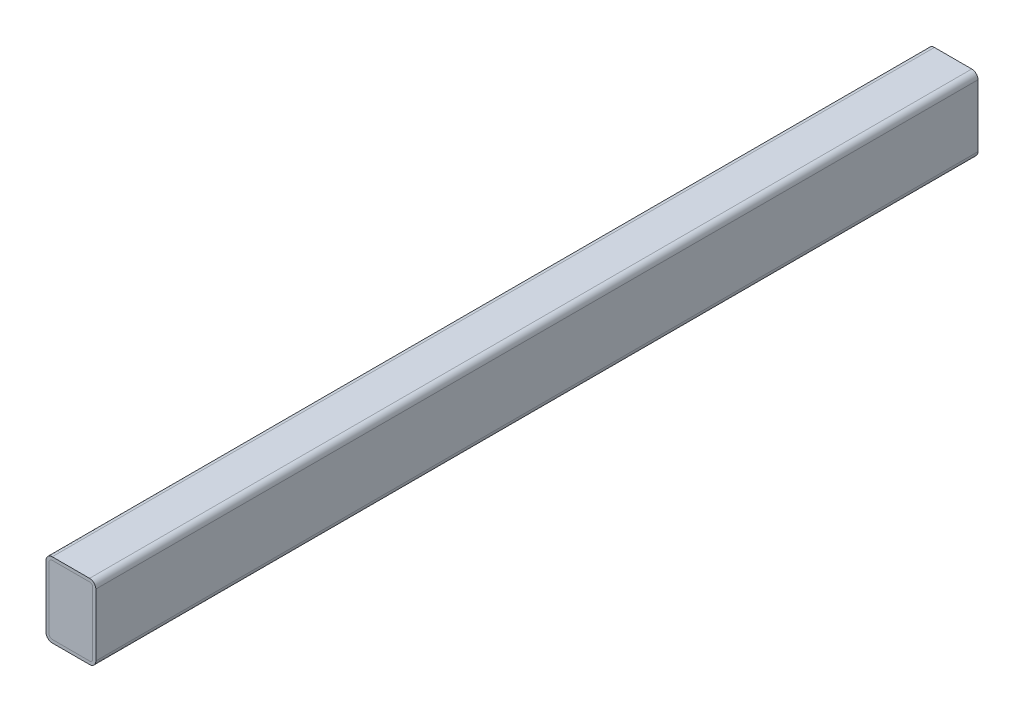
ISO-10303-21;
HEADER;
FILE_DESCRIPTION(('STEP AP214'),'2;1');
FILE_NAME('part.step','',(''),(''),'','','');
FILE_SCHEMA(('AUTOMOTIVE_DESIGN { 1 0 10303 214 1 1 1 1 }'));
ENDSEC;
DATA;
#1=APPLICATION_CONTEXT('core data for automotive mechanical design processes');
#2=APPLICATION_PROTOCOL_DEFINITION('international standard','automotive_design',2000,#1);
#3=PRODUCT_CONTEXT('',#1,'mechanical');
#4=PRODUCT('Part','Part','',(#3));
#5=PRODUCT_RELATED_PRODUCT_CATEGORY('part','',(#4));
#6=PRODUCT_DEFINITION_FORMATION('','',#4);
#7=PRODUCT_DEFINITION_CONTEXT('part definition',#1,'design');
#8=PRODUCT_DEFINITION('design','',#6,#7);
#9=PRODUCT_DEFINITION_SHAPE('','',#8);
#10=(LENGTH_UNIT() NAMED_UNIT(*) SI_UNIT(.MILLI.,.METRE.));
#11=(NAMED_UNIT(*) PLANE_ANGLE_UNIT() SI_UNIT($,.RADIAN.));
#12=(NAMED_UNIT(*) SI_UNIT($,.STERADIAN.) SOLID_ANGLE_UNIT());
#13=UNCERTAINTY_MEASURE_WITH_UNIT(LENGTH_MEASURE(1.E-05),#10,'distance_accuracy_value','');
#14=(GEOMETRIC_REPRESENTATION_CONTEXT(3) GLOBAL_UNCERTAINTY_ASSIGNED_CONTEXT((#13)) GLOBAL_UNIT_ASSIGNED_CONTEXT((#10,
#11,#12)) REPRESENTATION_CONTEXT('',''));
#15=CARTESIAN_POINT('',(0.,0.,0.));
#16=DIRECTION('',(0.,0.,1.));
#17=DIRECTION('',(1.,0.,0.));
#18=AXIS2_PLACEMENT_3D('',#15,#16,#17);
#19=CARTESIAN_POINT('',(-19.05,-31.75,-532.754870546074));
#20=DIRECTION('',(0.,0.,1.));
#21=DIRECTION('',(1.,0.,0.));
#22=AXIS2_PLACEMENT_3D('',#19,#20,#21);
#23=CYLINDRICAL_SURFACE('',#22,3.17500000000001);
#24=CARTESIAN_POINT('',(-19.05,-31.75,-449.961));
#25=DIRECTION('',(0.,0.,1.));
#26=DIRECTION('',(1.,0.,0.));
#27=AXIS2_PLACEMENT_3D('',#24,#25,#26);
#28=CIRCLE('',#27,3.17500000000001);
#29=CARTESIAN_POINT('',(-19.05,-34.925,-449.961));
#30=VERTEX_POINT('',#29);
#31=CARTESIAN_POINT('',(-22.225,-31.75,-449.961));
#32=VERTEX_POINT('',#31);
#33=EDGE_CURVE('E54',#30,#32,#28,.F.);
#34=ORIENTED_EDGE('',*,*,#33,.F.);
#35=DIRECTION('',(0.,0.,1.));
#36=VECTOR('',#35,1.);
#37=CARTESIAN_POINT('',(-19.05,-34.925,-532.754870546074));
#38=LINE('',#37,#36);
#39=CARTESIAN_POINT('',(-19.05,-34.925,449.961));
#40=VERTEX_POINT('',#39);
#41=EDGE_CURVE('E127',#30,#40,#38,.T.);
#42=ORIENTED_EDGE('',*,*,#41,.T.);
#43=CARTESIAN_POINT('',(-19.05,-31.75,449.961));
#44=DIRECTION('',(0.,0.,1.));
#45=DIRECTION('',(1.,0.,0.));
#46=AXIS2_PLACEMENT_3D('',#43,#44,#45);
#47=CIRCLE('',#46,3.17500000000001);
#48=CARTESIAN_POINT('',(-22.225,-31.75,449.961));
#49=VERTEX_POINT('',#48);
#50=EDGE_CURVE('E154',#49,#40,#47,.T.);
#51=ORIENTED_EDGE('',*,*,#50,.F.);
#52=DIRECTION('',(0.,0.,1.));
#53=VECTOR('',#52,1.);
#54=CARTESIAN_POINT('',(-22.225,-31.75,-532.754870546074));
#55=LINE('',#54,#53);
#56=EDGE_CURVE('E114',#32,#49,#55,.T.);
#57=ORIENTED_EDGE('',*,*,#56,.F.);
#58=EDGE_LOOP('',(#34,#42,#51,#57));
#59=FACE_BOUND('',#58,.T.);
#60=ADVANCED_FACE('F47',(#59),#23,.T.);
#61=CARTESIAN_POINT('',(-22.225,31.75,-532.754870546074));
#62=DIRECTION('',(-1.,0.,0.));
#63=DIRECTION('',(0.,-1.,0.));
#64=AXIS2_PLACEMENT_3D('',#61,#62,#63);
#65=PLANE('',#64);
#66=DIRECTION('',(0.,1.,0.));
#67=VECTOR('',#66,1.);
#68=CARTESIAN_POINT('',(-22.225,31.75,-449.961));
#69=LINE('',#68,#67);
#70=CARTESIAN_POINT('',(-22.225,31.75,-449.961));
#71=VERTEX_POINT('',#70);
#72=EDGE_CURVE('E91',#32,#71,#69,.T.);
#73=ORIENTED_EDGE('',*,*,#72,.F.);
#74=ORIENTED_EDGE('',*,*,#56,.T.);
#75=DIRECTION('',(0.,-1.,0.));
#76=VECTOR('',#75,1.);
#77=CARTESIAN_POINT('',(-22.225,31.75,449.961));
#78=LINE('',#77,#76);
#79=CARTESIAN_POINT('',(-22.225,31.75,449.961));
#80=VERTEX_POINT('',#79);
#81=EDGE_CURVE('E129',#80,#49,#78,.T.);
#82=ORIENTED_EDGE('',*,*,#81,.F.);
#83=DIRECTION('',(0.,0.,1.));
#84=VECTOR('',#83,1.);
#85=CARTESIAN_POINT('',(-22.225,31.75,-532.754870546074));
#86=LINE('',#85,#84);
#87=EDGE_CURVE('E112',#71,#80,#86,.T.);
#88=ORIENTED_EDGE('',*,*,#87,.F.);
#89=EDGE_LOOP('',(#73,#74,#82,#88));
#90=FACE_BOUND('',#89,.T.);
#91=ADVANCED_FACE('F179',(#90),#65,.T.);
#92=CARTESIAN_POINT('',(-19.05,31.75,-532.754870546074));
#93=DIRECTION('',(0.,0.,1.));
#94=DIRECTION('',(1.,0.,0.));
#95=AXIS2_PLACEMENT_3D('',#92,#93,#94);
#96=CYLINDRICAL_SURFACE('',#95,3.175);
#97=CARTESIAN_POINT('',(-19.05,31.75,-449.961));
#98=DIRECTION('',(0.,0.,1.));
#99=DIRECTION('',(1.,0.,0.));
#100=AXIS2_PLACEMENT_3D('',#97,#98,#99);
#101=CIRCLE('',#100,3.175);
#102=CARTESIAN_POINT('',(-19.05,34.925,-449.961));
#103=VERTEX_POINT('',#102);
#104=EDGE_CURVE('E87',#71,#103,#101,.F.);
#105=ORIENTED_EDGE('',*,*,#104,.F.);
#106=ORIENTED_EDGE('',*,*,#87,.T.);
#107=CARTESIAN_POINT('',(-19.05,31.75,449.961));
#108=DIRECTION('',(0.,0.,1.));
#109=DIRECTION('',(1.,0.,0.));
#110=AXIS2_PLACEMENT_3D('',#107,#108,#109);
#111=CIRCLE('',#110,3.175);
#112=CARTESIAN_POINT('',(-19.05,34.925,449.961));
#113=VERTEX_POINT('',#112);
#114=EDGE_CURVE('E110',#113,#80,#111,.T.);
#115=ORIENTED_EDGE('',*,*,#114,.F.);
#116=DIRECTION('',(0.,0.,1.));
#117=VECTOR('',#116,1.);
#118=CARTESIAN_POINT('',(-19.05,34.925,-532.754870546074));
#119=LINE('',#118,#117);
#120=EDGE_CURVE('E103',#103,#113,#119,.T.);
#121=ORIENTED_EDGE('',*,*,#120,.F.);
#122=EDGE_LOOP('',(#105,#106,#115,#121));
#123=FACE_BOUND('',#122,.T.);
#124=ADVANCED_FACE('F108',(#123),#96,.T.);
#125=CARTESIAN_POINT('',(19.05,34.925,-532.754870546074));
#126=DIRECTION('',(0.,1.,0.));
#127=DIRECTION('',(0.,0.,1.));
#128=AXIS2_PLACEMENT_3D('',#125,#126,#127);
#129=PLANE('',#128);
#130=DIRECTION('',(1.,0.,0.));
#131=VECTOR('',#130,1.);
#132=CARTESIAN_POINT('',(19.05,34.925,-449.961));
#133=LINE('',#132,#131);
#134=CARTESIAN_POINT('',(19.05,34.925,-449.961));
#135=VERTEX_POINT('',#134);
#136=EDGE_CURVE('E90',#103,#135,#133,.T.);
#137=ORIENTED_EDGE('',*,*,#136,.F.);
#138=ORIENTED_EDGE('',*,*,#120,.T.);
#139=DIRECTION('',(-1.,0.,0.));
#140=VECTOR('',#139,1.);
#141=CARTESIAN_POINT('',(19.05,34.925,449.961));
#142=LINE('',#141,#140);
#143=CARTESIAN_POINT('',(19.05,34.925,449.961));
#144=VERTEX_POINT('',#143);
#145=EDGE_CURVE('E140',#144,#113,#142,.T.);
#146=ORIENTED_EDGE('',*,*,#145,.F.);
#147=DIRECTION('',(0.,0.,1.));
#148=VECTOR('',#147,1.);
#149=CARTESIAN_POINT('',(19.05,34.925,-532.754870546074));
#150=LINE('',#149,#148);
#151=EDGE_CURVE('E106',#135,#144,#150,.T.);
#152=ORIENTED_EDGE('',*,*,#151,.F.);
#153=EDGE_LOOP('',(#137,#138,#146,#152));
#154=FACE_BOUND('',#153,.T.);
#155=ADVANCED_FACE('F100',(#154),#129,.T.);
#156=CARTESIAN_POINT('',(19.05,31.75,-532.754870546074));
#157=DIRECTION('',(0.,0.,1.));
#158=DIRECTION('',(1.,0.,0.));
#159=AXIS2_PLACEMENT_3D('',#156,#157,#158);
#160=CYLINDRICAL_SURFACE('',#159,3.175);
#161=CARTESIAN_POINT('',(19.05,31.75,-449.961));
#162=DIRECTION('',(0.,0.,1.));
#163=DIRECTION('',(1.,0.,0.));
#164=AXIS2_PLACEMENT_3D('',#161,#162,#163);
#165=CIRCLE('',#164,3.175);
#166=CARTESIAN_POINT('',(22.225,31.75,-449.961));
#167=VERTEX_POINT('',#166);
#168=EDGE_CURVE('E67',#135,#167,#165,.F.);
#169=ORIENTED_EDGE('',*,*,#168,.F.);
#170=ORIENTED_EDGE('',*,*,#151,.T.);
#171=CARTESIAN_POINT('',(19.05,31.75,449.961));
#172=DIRECTION('',(0.,0.,1.));
#173=DIRECTION('',(1.,0.,0.));
#174=AXIS2_PLACEMENT_3D('',#171,#172,#173);
#175=CIRCLE('',#174,3.175);
#176=CARTESIAN_POINT('',(22.225,31.75,449.961));
#177=VERTEX_POINT('',#176);
#178=EDGE_CURVE('E165',#177,#144,#175,.T.);
#179=ORIENTED_EDGE('',*,*,#178,.F.);
#180=DIRECTION('',(0.,0.,1.));
#181=VECTOR('',#180,1.);
#182=CARTESIAN_POINT('',(22.225,31.75,-532.754870546074));
#183=LINE('',#182,#181);
#184=EDGE_CURVE('E116',#167,#177,#183,.T.);
#185=ORIENTED_EDGE('',*,*,#184,.F.);
#186=EDGE_LOOP('',(#169,#170,#179,#185));
#187=FACE_BOUND('',#186,.T.);
#188=ADVANCED_FACE('F191',(#187),#160,.T.);
#189=CARTESIAN_POINT('',(22.225,-31.75,-532.754870546074));
#190=DIRECTION('',(1.,0.,0.));
#191=DIRECTION('',(0.,1.,0.));
#192=AXIS2_PLACEMENT_3D('',#189,#190,#191);
#193=PLANE('',#192);
#194=DIRECTION('',(0.,-1.,0.));
#195=VECTOR('',#194,1.);
#196=CARTESIAN_POINT('',(22.225,-31.75,-449.961));
#197=LINE('',#196,#195);
#198=CARTESIAN_POINT('',(22.225,-31.75,-449.961));
#199=VERTEX_POINT('',#198);
#200=EDGE_CURVE('E61',#167,#199,#197,.T.);
#201=ORIENTED_EDGE('',*,*,#200,.F.);
#202=ORIENTED_EDGE('',*,*,#184,.T.);
#203=DIRECTION('',(0.,1.,0.));
#204=VECTOR('',#203,1.);
#205=CARTESIAN_POINT('',(22.225,-31.75,449.961));
#206=LINE('',#205,#204);
#207=CARTESIAN_POINT('',(22.225,-31.75,449.961));
#208=VERTEX_POINT('',#207);
#209=EDGE_CURVE('E162',#208,#177,#206,.T.);
#210=ORIENTED_EDGE('',*,*,#209,.F.);
#211=DIRECTION('',(0.,0.,1.));
#212=VECTOR('',#211,1.);
#213=CARTESIAN_POINT('',(22.225,-31.75,-532.754870546074));
#214=LINE('',#213,#212);
#215=EDGE_CURVE('E122',#199,#208,#214,.T.);
#216=ORIENTED_EDGE('',*,*,#215,.F.);
#217=EDGE_LOOP('',(#201,#202,#210,#216));
#218=FACE_BOUND('',#217,.T.);
#219=ADVANCED_FACE('F189',(#218),#193,.T.);
#220=CARTESIAN_POINT('',(19.05,-31.75,-532.754870546074));
#221=DIRECTION('',(0.,0.,1.));
#222=DIRECTION('',(1.,0.,0.));
#223=AXIS2_PLACEMENT_3D('',#220,#221,#222);
#224=CYLINDRICAL_SURFACE('',#223,3.17500000000001);
#225=CARTESIAN_POINT('',(19.05,-31.75,-449.961));
#226=DIRECTION('',(0.,0.,1.));
#227=DIRECTION('',(1.,0.,0.));
#228=AXIS2_PLACEMENT_3D('',#225,#226,#227);
#229=CIRCLE('',#228,3.17500000000001);
#230=CARTESIAN_POINT('',(19.05,-34.925,-449.961));
#231=VERTEX_POINT('',#230);
#232=EDGE_CURVE('E144',#199,#231,#229,.F.);
#233=ORIENTED_EDGE('',*,*,#232,.F.);
#234=ORIENTED_EDGE('',*,*,#215,.T.);
#235=CARTESIAN_POINT('',(19.05,-31.75,449.961));
#236=DIRECTION('',(0.,0.,1.));
#237=DIRECTION('',(1.,0.,0.));
#238=AXIS2_PLACEMENT_3D('',#235,#236,#237);
#239=CIRCLE('',#238,3.17500000000001);
#240=CARTESIAN_POINT('',(19.05,-34.925,449.961));
#241=VERTEX_POINT('',#240);
#242=EDGE_CURVE('E159',#241,#208,#239,.T.);
#243=ORIENTED_EDGE('',*,*,#242,.F.);
#244=DIRECTION('',(0.,0.,1.));
#245=VECTOR('',#244,1.);
#246=CARTESIAN_POINT('',(19.05,-34.925,-532.754870546074));
#247=LINE('',#246,#245);
#248=EDGE_CURVE('E125',#231,#241,#247,.T.);
#249=ORIENTED_EDGE('',*,*,#248,.F.);
#250=EDGE_LOOP('',(#233,#234,#243,#249));
#251=FACE_BOUND('',#250,.T.);
#252=ADVANCED_FACE('F187',(#251),#224,.T.);
#253=CARTESIAN_POINT('',(-19.05,-34.925,-532.754870546074));
#254=DIRECTION('',(0.,-1.,0.));
#255=DIRECTION('',(0.,0.,-1.));
#256=AXIS2_PLACEMENT_3D('',#253,#254,#255);
#257=PLANE('',#256);
#258=DIRECTION('',(-1.,0.,0.));
#259=VECTOR('',#258,1.);
#260=CARTESIAN_POINT('',(-19.05,-34.925,-449.961));
#261=LINE('',#260,#259);
#262=EDGE_CURVE('E12',#231,#30,#261,.T.);
#263=ORIENTED_EDGE('',*,*,#262,.F.);
#264=ORIENTED_EDGE('',*,*,#248,.T.);
#265=DIRECTION('',(1.,0.,0.));
#266=VECTOR('',#265,1.);
#267=CARTESIAN_POINT('',(-19.05,-34.925,449.961));
#268=LINE('',#267,#266);
#269=EDGE_CURVE('E156',#40,#241,#268,.T.);
#270=ORIENTED_EDGE('',*,*,#269,.F.);
#271=ORIENTED_EDGE('',*,*,#41,.F.);
#272=EDGE_LOOP('',(#263,#264,#270,#271));
#273=FACE_BOUND('',#272,.T.);
#274=ADVANCED_FACE('F212',(#273),#257,.T.);
#275=CARTESIAN_POINT('',(-19.05,-31.75,449.961));
#276=DIRECTION('',(0.,0.,1.));
#277=DIRECTION('',(1.,0.,0.));
#278=AXIS2_PLACEMENT_3D('',#275,#276,#277);
#279=PLANE('',#278);
#280=ORIENTED_EDGE('',*,*,#50,.T.);
#281=ORIENTED_EDGE('',*,*,#269,.T.);
#282=ORIENTED_EDGE('',*,*,#242,.T.);
#283=ORIENTED_EDGE('',*,*,#209,.T.);
#284=ORIENTED_EDGE('',*,*,#178,.T.);
#285=ORIENTED_EDGE('',*,*,#145,.T.);
#286=ORIENTED_EDGE('',*,*,#114,.T.);
#287=ORIENTED_EDGE('',*,*,#81,.T.);
#288=EDGE_LOOP('',(#280,#281,#282,#283,#284,#285,#286,#287));
#289=FACE_BOUND('',#288,.T.);
#290=ADVANCED_FACE('F167',(#289),#279,.T.);
#291=CARTESIAN_POINT('',(-19.05,-31.75,-449.961));
#292=DIRECTION('',(0.,0.,1.));
#293=DIRECTION('',(1.,0.,0.));
#294=AXIS2_PLACEMENT_3D('',#291,#292,#293);
#295=PLANE('',#294);
#296=ORIENTED_EDGE('',*,*,#33,.T.);
#297=ORIENTED_EDGE('',*,*,#72,.T.);
#298=ORIENTED_EDGE('',*,*,#104,.T.);
#299=ORIENTED_EDGE('',*,*,#136,.T.);
#300=ORIENTED_EDGE('',*,*,#168,.T.);
#301=ORIENTED_EDGE('',*,*,#200,.T.);
#302=ORIENTED_EDGE('',*,*,#232,.T.);
#303=ORIENTED_EDGE('',*,*,#262,.T.);
#304=EDGE_LOOP('',(#296,#297,#298,#299,#300,#301,#302,#303));
#305=FACE_BOUND('',#304,.T.);
#306=ADVANCED_FACE('F89',(#305),#295,.F.);
#307=CLOSED_SHELL('',(#60,#91,#124,#155,#188,#219,#252,#274,#290,#306));
#308=MANIFOLD_SOLID_BREP('B2',#307);
#309=CARTESIAN_POINT('',(-19.05,-31.75,449.961));
#310=DIRECTION('',(0.,0.,1.));
#311=DIRECTION('',(1.,0.,0.));
#312=AXIS2_PLACEMENT_3D('',#309,#310,#311);
#313=PLANE('',#312);
#314=CARTESIAN_POINT('',(-19.05,-31.75,449.961));
#315=DIRECTION('',(0.,0.,1.));
#316=DIRECTION('',(1.,0.,0.));
#317=AXIS2_PLACEMENT_3D('',#314,#315,#316);
#318=CIRCLE('',#317,6.35000000000001);
#319=CARTESIAN_POINT('',(-25.4,-31.75,449.961));
#320=VERTEX_POINT('',#319);
#321=CARTESIAN_POINT('',(-19.05,-38.1,449.961));
#322=VERTEX_POINT('',#321);
#323=EDGE_CURVE('E453',#320,#322,#318,.T.);
#324=ORIENTED_EDGE('',*,*,#323,.T.);
#325=DIRECTION('',(1.,0.,0.));
#326=VECTOR('',#325,1.);
#327=CARTESIAN_POINT('',(19.05,-38.1,449.961));
#328=LINE('',#327,#326);
#329=CARTESIAN_POINT('',(19.05,-38.1,449.961));
#330=VERTEX_POINT('',#329);
#331=EDGE_CURVE('E456',#322,#330,#328,.T.);
#332=ORIENTED_EDGE('',*,*,#331,.T.);
#333=CARTESIAN_POINT('',(19.05,-31.75,449.961));
#334=DIRECTION('',(0.,0.,1.));
#335=DIRECTION('',(1.,0.,0.));
#336=AXIS2_PLACEMENT_3D('',#333,#334,#335);
#337=CIRCLE('',#336,6.35);
#338=CARTESIAN_POINT('',(25.4,-31.75,449.961));
#339=VERTEX_POINT('',#338);
#340=EDGE_CURVE('E459',#330,#339,#337,.T.);
#341=ORIENTED_EDGE('',*,*,#340,.T.);
#342=DIRECTION('',(0.,1.,0.));
#343=VECTOR('',#342,1.);
#344=CARTESIAN_POINT('',(25.4,31.75,449.961));
#345=LINE('',#344,#343);
#346=CARTESIAN_POINT('',(25.4,31.75,449.961));
#347=VERTEX_POINT('',#346);
#348=EDGE_CURVE('E461',#339,#347,#345,.T.);
#349=ORIENTED_EDGE('',*,*,#348,.T.);
#350=CARTESIAN_POINT('',(19.05,31.75,449.961));
#351=DIRECTION('',(0.,0.,1.));
#352=DIRECTION('',(1.,0.,0.));
#353=AXIS2_PLACEMENT_3D('',#350,#351,#352);
#354=CIRCLE('',#353,6.35);
#355=CARTESIAN_POINT('',(19.05,38.1,449.961));
#356=VERTEX_POINT('',#355);
#357=EDGE_CURVE('E463',#347,#356,#354,.T.);
#358=ORIENTED_EDGE('',*,*,#357,.T.);
#359=DIRECTION('',(-1.,0.,0.));
#360=VECTOR('',#359,1.);
#361=CARTESIAN_POINT('',(-19.05,38.1,449.961));
#362=LINE('',#361,#360);
#363=CARTESIAN_POINT('',(-19.05,38.1,449.961));
#364=VERTEX_POINT('',#363);
#365=EDGE_CURVE('E465',#356,#364,#362,.T.);
#366=ORIENTED_EDGE('',*,*,#365,.T.);
#367=CARTESIAN_POINT('',(-19.05,31.75,449.961));
#368=DIRECTION('',(0.,0.,1.));
#369=DIRECTION('',(1.,0.,0.));
#370=AXIS2_PLACEMENT_3D('',#367,#368,#369);
#371=CIRCLE('',#370,6.35);
#372=CARTESIAN_POINT('',(-25.4,31.75,449.961));
#373=VERTEX_POINT('',#372);
#374=EDGE_CURVE('E467',#364,#373,#371,.T.);
#375=ORIENTED_EDGE('',*,*,#374,.T.);
#376=DIRECTION('',(0.,-1.,0.));
#377=VECTOR('',#376,1.);
#378=CARTESIAN_POINT('',(-25.4,-31.75,449.961));
#379=LINE('',#378,#377);
#380=EDGE_CURVE('E469',#373,#320,#379,.T.);
#381=ORIENTED_EDGE('',*,*,#380,.T.);
#382=EDGE_LOOP('',(#324,#332,#341,#349,#358,#366,#375,#381));
#383=FACE_BOUND('',#382,.T.);
#384=DIRECTION('',(1.,0.,0.));
#385=VECTOR('',#384,1.);
#386=CARTESIAN_POINT('',(19.05,-34.925,449.961));
#387=LINE('',#386,#385);
#388=CARTESIAN_POINT('',(-19.05,-34.925,449.961));
#389=VERTEX_POINT('',#388);
#390=CARTESIAN_POINT('',(19.05,-34.925,449.961));
#391=VERTEX_POINT('',#390);
#392=EDGE_CURVE('E396',#389,#391,#387,.T.);
#393=ORIENTED_EDGE('',*,*,#392,.F.);
#394=CARTESIAN_POINT('',(-19.05,-31.75,449.961));
#395=DIRECTION('',(0.,0.,1.));
#396=DIRECTION('',(1.,0.,0.));
#397=AXIS2_PLACEMENT_3D('',#394,#395,#396);
#398=CIRCLE('',#397,3.17500000000001);
#399=CARTESIAN_POINT('',(-22.225,-31.75,449.961));
#400=VERTEX_POINT('',#399);
#401=EDGE_CURVE('E388',#400,#389,#398,.T.);
#402=ORIENTED_EDGE('',*,*,#401,.F.);
#403=DIRECTION('',(0.,-1.,0.));
#404=VECTOR('',#403,1.);
#405=CARTESIAN_POINT('',(-22.225,-31.75,449.961));
#406=LINE('',#405,#404);
#407=CARTESIAN_POINT('',(-22.225,31.75,449.961));
#408=VERTEX_POINT('',#407);
#409=EDGE_CURVE('E421',#408,#400,#406,.T.);
#410=ORIENTED_EDGE('',*,*,#409,.F.);
#411=CARTESIAN_POINT('',(-19.05,31.75,449.961));
#412=DIRECTION('',(0.,0.,1.));
#413=DIRECTION('',(1.,0.,0.));
#414=AXIS2_PLACEMENT_3D('',#411,#412,#413);
#415=CIRCLE('',#414,3.175);
#416=CARTESIAN_POINT('',(-19.05,34.925,449.961));
#417=VERTEX_POINT('',#416);
#418=EDGE_CURVE('E419',#417,#408,#415,.T.);
#419=ORIENTED_EDGE('',*,*,#418,.F.);
#420=DIRECTION('',(-1.,0.,0.));
#421=VECTOR('',#420,1.);
#422=CARTESIAN_POINT('',(-19.05,34.925,449.961));
#423=LINE('',#422,#421);
#424=CARTESIAN_POINT('',(19.05,34.925,449.961));
#425=VERTEX_POINT('',#424);
#426=EDGE_CURVE('E417',#425,#417,#423,.T.);
#427=ORIENTED_EDGE('',*,*,#426,.F.);
#428=CARTESIAN_POINT('',(19.05,31.75,449.961));
#429=DIRECTION('',(0.,0.,1.));
#430=DIRECTION('',(1.,0.,0.));
#431=AXIS2_PLACEMENT_3D('',#428,#429,#430);
#432=CIRCLE('',#431,3.175);
#433=CARTESIAN_POINT('',(22.225,31.75,449.961));
#434=VERTEX_POINT('',#433);
#435=EDGE_CURVE('E415',#434,#425,#432,.T.);
#436=ORIENTED_EDGE('',*,*,#435,.F.);
#437=DIRECTION('',(0.,1.,0.));
#438=VECTOR('',#437,1.);
#439=CARTESIAN_POINT('',(22.225,31.75,449.961));
#440=LINE('',#439,#438);
#441=CARTESIAN_POINT('',(22.225,-31.75,449.961));
#442=VERTEX_POINT('',#441);
#443=EDGE_CURVE('E411',#442,#434,#440,.T.);
#444=ORIENTED_EDGE('',*,*,#443,.F.);
#445=CARTESIAN_POINT('',(19.05,-31.75,449.961));
#446=DIRECTION('',(0.,0.,1.));
#447=DIRECTION('',(1.,0.,0.));
#448=AXIS2_PLACEMENT_3D('',#445,#446,#447);
#449=CIRCLE('',#448,3.17500000000001);
#450=EDGE_CURVE('E409',#391,#442,#449,.T.);
#451=ORIENTED_EDGE('',*,*,#450,.F.);
#452=EDGE_LOOP('',(#393,#402,#410,#419,#427,#436,#444,#451));
#453=FACE_BOUND('',#452,.T.);
#454=ADVANCED_FACE('F275',(#383,#453),#313,.T.);
#455=CARTESIAN_POINT('',(-19.05,-31.75,-449.961));
#456=DIRECTION('',(0.,0.,1.));
#457=DIRECTION('',(1.,0.,0.));
#458=AXIS2_PLACEMENT_3D('',#455,#456,#457);
#459=PLANE('',#458);
#460=CARTESIAN_POINT('',(-19.05,-31.75,-449.961));
#461=DIRECTION('',(0.,0.,1.));
#462=DIRECTION('',(1.,0.,0.));
#463=AXIS2_PLACEMENT_3D('',#460,#461,#462);
#464=CIRCLE('',#463,6.35000000000001);
#465=CARTESIAN_POINT('',(-25.4,-31.75,-449.961));
#466=VERTEX_POINT('',#465);
#467=CARTESIAN_POINT('',(-19.05,-38.1,-449.961));
#468=VERTEX_POINT('',#467);
#469=EDGE_CURVE('E404',#466,#468,#464,.T.);
#470=ORIENTED_EDGE('',*,*,#469,.F.);
#471=DIRECTION('',(0.,-1.,0.));
#472=VECTOR('',#471,1.);
#473=CARTESIAN_POINT('',(-25.4,-31.75,-449.961));
#474=LINE('',#473,#472);
#475=CARTESIAN_POINT('',(-25.4,31.75,-449.961));
#476=VERTEX_POINT('',#475);
#477=EDGE_CURVE('E457',#476,#466,#474,.T.);
#478=ORIENTED_EDGE('',*,*,#477,.F.);
#479=CARTESIAN_POINT('',(-19.05,31.75,-449.961));
#480=DIRECTION('',(0.,0.,1.));
#481=DIRECTION('',(1.,0.,0.));
#482=AXIS2_PLACEMENT_3D('',#479,#480,#481);
#483=CIRCLE('',#482,6.35);
#484=CARTESIAN_POINT('',(-19.05,38.1,-449.961));
#485=VERTEX_POINT('',#484);
#486=EDGE_CURVE('E484',#485,#476,#483,.T.);
#487=ORIENTED_EDGE('',*,*,#486,.F.);
#488=DIRECTION('',(-1.,0.,0.));
#489=VECTOR('',#488,1.);
#490=CARTESIAN_POINT('',(-19.05,38.1,-449.961));
#491=LINE('',#490,#489);
#492=CARTESIAN_POINT('',(19.05,38.1,-449.961));
#493=VERTEX_POINT('',#492);
#494=EDGE_CURVE('E482',#493,#485,#491,.T.);
#495=ORIENTED_EDGE('',*,*,#494,.F.);
#496=CARTESIAN_POINT('',(19.05,31.75,-449.961));
#497=DIRECTION('',(0.,0.,1.));
#498=DIRECTION('',(1.,0.,0.));
#499=AXIS2_PLACEMENT_3D('',#496,#497,#498);
#500=CIRCLE('',#499,6.35);
#501=CARTESIAN_POINT('',(25.4,31.75,-449.961));
#502=VERTEX_POINT('',#501);
#503=EDGE_CURVE('E480',#502,#493,#500,.T.);
#504=ORIENTED_EDGE('',*,*,#503,.F.);
#505=DIRECTION('',(0.,1.,0.));
#506=VECTOR('',#505,1.);
#507=CARTESIAN_POINT('',(25.4,31.75,-449.961));
#508=LINE('',#507,#506);
#509=CARTESIAN_POINT('',(25.4,-31.75,-449.961));
#510=VERTEX_POINT('',#509);
#511=EDGE_CURVE('E478',#510,#502,#508,.T.);
#512=ORIENTED_EDGE('',*,*,#511,.F.);
#513=CARTESIAN_POINT('',(19.05,-31.75,-449.961));
#514=DIRECTION('',(0.,0.,1.));
#515=DIRECTION('',(1.,0.,0.));
#516=AXIS2_PLACEMENT_3D('',#513,#514,#515);
#517=CIRCLE('',#516,6.35);
#518=CARTESIAN_POINT('',(19.05,-38.1,-449.961));
#519=VERTEX_POINT('',#518);
#520=EDGE_CURVE('E476',#519,#510,#517,.T.);
#521=ORIENTED_EDGE('',*,*,#520,.F.);
#522=DIRECTION('',(1.,0.,0.));
#523=VECTOR('',#522,1.);
#524=CARTESIAN_POINT('',(19.05,-38.1,-449.961));
#525=LINE('',#524,#523);
#526=EDGE_CURVE('E474',#468,#519,#525,.T.);
#527=ORIENTED_EDGE('',*,*,#526,.F.);
#528=EDGE_LOOP('',(#470,#478,#487,#495,#504,#512,#521,#527));
#529=FACE_BOUND('',#528,.T.);
#530=CARTESIAN_POINT('',(-19.05,-31.75,-449.961));
#531=DIRECTION('',(0.,0.,1.));
#532=DIRECTION('',(1.,0.,0.));
#533=AXIS2_PLACEMENT_3D('',#530,#531,#532);
#534=CIRCLE('',#533,3.17500000000001);
#535=CARTESIAN_POINT('',(-22.225,-31.75,-449.961));
#536=VERTEX_POINT('',#535);
#537=CARTESIAN_POINT('',(-19.05,-34.925,-449.961));
#538=VERTEX_POINT('',#537);
#539=EDGE_CURVE('E298',#536,#538,#534,.T.);
#540=ORIENTED_EDGE('',*,*,#539,.T.);
#541=DIRECTION('',(1.,0.,0.));
#542=VECTOR('',#541,1.);
#543=CARTESIAN_POINT('',(19.05,-34.925,-449.961));
#544=LINE('',#543,#542);
#545=CARTESIAN_POINT('',(19.05,-34.925,-449.961));
#546=VERTEX_POINT('',#545);
#547=EDGE_CURVE('E403',#538,#546,#544,.T.);
#548=ORIENTED_EDGE('',*,*,#547,.T.);
#549=CARTESIAN_POINT('',(19.05,-31.75,-449.961));
#550=DIRECTION('',(0.,0.,1.));
#551=DIRECTION('',(1.,0.,0.));
#552=AXIS2_PLACEMENT_3D('',#549,#550,#551);
#553=CIRCLE('',#552,3.17500000000001);
#554=CARTESIAN_POINT('',(22.225,-31.75,-449.961));
#555=VERTEX_POINT('',#554);
#556=EDGE_CURVE('E425',#546,#555,#553,.T.);
#557=ORIENTED_EDGE('',*,*,#556,.T.);
#558=DIRECTION('',(0.,1.,0.));
#559=VECTOR('',#558,1.);
#560=CARTESIAN_POINT('',(22.225,31.75,-449.961));
#561=LINE('',#560,#559);
#562=CARTESIAN_POINT('',(22.225,31.75,-449.961));
#563=VERTEX_POINT('',#562);
#564=EDGE_CURVE('E428',#555,#563,#561,.T.);
#565=ORIENTED_EDGE('',*,*,#564,.T.);
#566=CARTESIAN_POINT('',(19.05,31.75,-449.961));
#567=DIRECTION('',(0.,0.,1.));
#568=DIRECTION('',(1.,0.,0.));
#569=AXIS2_PLACEMENT_3D('',#566,#567,#568);
#570=CIRCLE('',#569,3.175);
#571=CARTESIAN_POINT('',(19.05,34.925,-449.961));
#572=VERTEX_POINT('',#571);
#573=EDGE_CURVE('E431',#563,#572,#570,.T.);
#574=ORIENTED_EDGE('',*,*,#573,.T.);
#575=DIRECTION('',(-1.,0.,0.));
#576=VECTOR('',#575,1.);
#577=CARTESIAN_POINT('',(-19.05,34.925,-449.961));
#578=LINE('',#577,#576);
#579=CARTESIAN_POINT('',(-19.05,34.925,-449.961));
#580=VERTEX_POINT('',#579);
#581=EDGE_CURVE('E434',#572,#580,#578,.T.);
#582=ORIENTED_EDGE('',*,*,#581,.T.);
#583=CARTESIAN_POINT('',(-19.05,31.75,-449.961));
#584=DIRECTION('',(0.,0.,1.));
#585=DIRECTION('',(1.,0.,0.));
#586=AXIS2_PLACEMENT_3D('',#583,#584,#585);
#587=CIRCLE('',#586,3.175);
#588=CARTESIAN_POINT('',(-22.225,31.75,-449.961));
#589=VERTEX_POINT('',#588);
#590=EDGE_CURVE('E437',#580,#589,#587,.T.);
#591=ORIENTED_EDGE('',*,*,#590,.T.);
#592=DIRECTION('',(0.,-1.,0.));
#593=VECTOR('',#592,1.);
#594=CARTESIAN_POINT('',(-22.225,-31.75,-449.961));
#595=LINE('',#594,#593);
#596=EDGE_CURVE('E397',#589,#536,#595,.T.);
#597=ORIENTED_EDGE('',*,*,#596,.T.);
#598=EDGE_LOOP('',(#540,#548,#557,#565,#574,#582,#591,#597));
#599=FACE_BOUND('',#598,.T.);
#600=ADVANCED_FACE('F514',(#529,#599),#459,.F.);
#601=CARTESIAN_POINT('',(-19.05,-31.75,449.961));
#602=DIRECTION('',(0.,0.,-1.));
#603=DIRECTION('',(-1.,0.,0.));
#604=AXIS2_PLACEMENT_3D('',#601,#602,#603);
#605=CYLINDRICAL_SURFACE('',#604,6.35000000000001);
#606=ORIENTED_EDGE('',*,*,#469,.T.);
#607=DIRECTION('',(0.,0.,-1.));
#608=VECTOR('',#607,1.);
#609=CARTESIAN_POINT('',(-19.05,-38.1,449.961));
#610=LINE('',#609,#608);
#611=EDGE_CURVE('E45',#322,#468,#610,.T.);
#612=ORIENTED_EDGE('',*,*,#611,.F.);
#613=ORIENTED_EDGE('',*,*,#323,.F.);
#614=DIRECTION('',(0.,0.,-1.));
#615=VECTOR('',#614,1.);
#616=CARTESIAN_POINT('',(-25.4,-31.75,449.961));
#617=LINE('',#616,#615);
#618=EDGE_CURVE('E471',#320,#466,#617,.T.);
#619=ORIENTED_EDGE('',*,*,#618,.T.);
#620=EDGE_LOOP('',(#606,#612,#613,#619));
#621=FACE_BOUND('',#620,.T.);
#622=ADVANCED_FACE('F277',(#621),#605,.T.);
#623=CARTESIAN_POINT('',(19.05,-38.1,449.961));
#624=DIRECTION('',(0.,1.,0.));
#625=DIRECTION('',(-1.,0.,0.));
#626=AXIS2_PLACEMENT_3D('',#623,#624,#625);
#627=PLANE('',#626);
#628=ORIENTED_EDGE('',*,*,#526,.T.);
#629=DIRECTION('',(0.,0.,-1.));
#630=VECTOR('',#629,1.);
#631=CARTESIAN_POINT('',(19.05,-38.1,449.961));
#632=LINE('',#631,#630);
#633=EDGE_CURVE('E283',#330,#519,#632,.T.);
#634=ORIENTED_EDGE('',*,*,#633,.F.);
#635=ORIENTED_EDGE('',*,*,#331,.F.);
#636=ORIENTED_EDGE('',*,*,#611,.T.);
#637=EDGE_LOOP('',(#628,#634,#635,#636));
#638=FACE_BOUND('',#637,.T.);
#639=ADVANCED_FACE('F531',(#638),#627,.F.);
#640=CARTESIAN_POINT('',(19.05,-31.75,449.961));
#641=DIRECTION('',(0.,0.,-1.));
#642=DIRECTION('',(-1.,0.,0.));
#643=AXIS2_PLACEMENT_3D('',#640,#641,#642);
#644=CYLINDRICAL_SURFACE('',#643,6.35);
#645=ORIENTED_EDGE('',*,*,#520,.T.);
#646=DIRECTION('',(0.,0.,-1.));
#647=VECTOR('',#646,1.);
#648=CARTESIAN_POINT('',(25.4,-31.75,449.961));
#649=LINE('',#648,#647);
#650=EDGE_CURVE('E501',#339,#510,#649,.T.);
#651=ORIENTED_EDGE('',*,*,#650,.F.);
#652=ORIENTED_EDGE('',*,*,#340,.F.);
#653=ORIENTED_EDGE('',*,*,#633,.T.);
#654=EDGE_LOOP('',(#645,#651,#652,#653));
#655=FACE_BOUND('',#654,.T.);
#656=ADVANCED_FACE('F508',(#655),#644,.T.);
#657=CARTESIAN_POINT('',(25.4,31.75,449.961));
#658=DIRECTION('',(-1.,0.,0.));
#659=DIRECTION('',(0.,-1.,0.));
#660=AXIS2_PLACEMENT_3D('',#657,#658,#659);
#661=PLANE('',#660);
#662=ORIENTED_EDGE('',*,*,#511,.T.);
#663=DIRECTION('',(0.,0.,-1.));
#664=VECTOR('',#663,1.);
#665=CARTESIAN_POINT('',(25.4,31.75,449.961));
#666=LINE('',#665,#664);
#667=EDGE_CURVE('E498',#347,#502,#666,.T.);
#668=ORIENTED_EDGE('',*,*,#667,.F.);
#669=ORIENTED_EDGE('',*,*,#348,.F.);
#670=ORIENTED_EDGE('',*,*,#650,.T.);
#671=EDGE_LOOP('',(#662,#668,#669,#670));
#672=FACE_BOUND('',#671,.T.);
#673=ADVANCED_FACE('F520',(#672),#661,.F.);
#674=CARTESIAN_POINT('',(19.05,31.75,449.961));
#675=DIRECTION('',(0.,0.,-1.));
#676=DIRECTION('',(-1.,0.,0.));
#677=AXIS2_PLACEMENT_3D('',#674,#675,#676);
#678=CYLINDRICAL_SURFACE('',#677,6.35);
#679=ORIENTED_EDGE('',*,*,#503,.T.);
#680=DIRECTION('',(0.,0.,-1.));
#681=VECTOR('',#680,1.);
#682=CARTESIAN_POINT('',(19.05,38.1,449.961));
#683=LINE('',#682,#681);
#684=EDGE_CURVE('E495',#356,#493,#683,.T.);
#685=ORIENTED_EDGE('',*,*,#684,.F.);
#686=ORIENTED_EDGE('',*,*,#357,.F.);
#687=ORIENTED_EDGE('',*,*,#667,.T.);
#688=EDGE_LOOP('',(#679,#685,#686,#687));
#689=FACE_BOUND('',#688,.T.);
#690=ADVANCED_FACE('F524',(#689),#678,.T.);
#691=CARTESIAN_POINT('',(-19.05,38.1,449.961));
#692=DIRECTION('',(0.,-1.,0.));
#693=DIRECTION('',(0.,0.,-1.));
#694=AXIS2_PLACEMENT_3D('',#691,#692,#693);
#695=PLANE('',#694);
#696=ORIENTED_EDGE('',*,*,#494,.T.);
#697=DIRECTION('',(0.,0.,-1.));
#698=VECTOR('',#697,1.);
#699=CARTESIAN_POINT('',(-19.05,38.1,449.961));
#700=LINE('',#699,#698);
#701=EDGE_CURVE('E492',#364,#485,#700,.T.);
#702=ORIENTED_EDGE('',*,*,#701,.F.);
#703=ORIENTED_EDGE('',*,*,#365,.F.);
#704=ORIENTED_EDGE('',*,*,#684,.T.);
#705=EDGE_LOOP('',(#696,#702,#703,#704));
#706=FACE_BOUND('',#705,.T.);
#707=ADVANCED_FACE('F544',(#706),#695,.F.);
#708=CARTESIAN_POINT('',(-19.05,31.75,449.961));
#709=DIRECTION('',(0.,0.,-1.));
#710=DIRECTION('',(-1.,0.,0.));
#711=AXIS2_PLACEMENT_3D('',#708,#709,#710);
#712=CYLINDRICAL_SURFACE('',#711,6.35);
#713=ORIENTED_EDGE('',*,*,#486,.T.);
#714=DIRECTION('',(0.,0.,-1.));
#715=VECTOR('',#714,1.);
#716=CARTESIAN_POINT('',(-25.4,31.75,449.961));
#717=LINE('',#716,#715);
#718=EDGE_CURVE('E489',#373,#476,#717,.T.);
#719=ORIENTED_EDGE('',*,*,#718,.F.);
#720=ORIENTED_EDGE('',*,*,#374,.F.);
#721=ORIENTED_EDGE('',*,*,#701,.T.);
#722=EDGE_LOOP('',(#713,#719,#720,#721));
#723=FACE_BOUND('',#722,.T.);
#724=ADVANCED_FACE('F542',(#723),#712,.T.);
#725=CARTESIAN_POINT('',(-25.4,-31.75,449.961));
#726=DIRECTION('',(1.,0.,0.));
#727=DIRECTION('',(0.,1.,0.));
#728=AXIS2_PLACEMENT_3D('',#725,#726,#727);
#729=PLANE('',#728);
#730=ORIENTED_EDGE('',*,*,#477,.T.);
#731=ORIENTED_EDGE('',*,*,#618,.F.);
#732=ORIENTED_EDGE('',*,*,#380,.F.);
#733=ORIENTED_EDGE('',*,*,#718,.T.);
#734=EDGE_LOOP('',(#730,#731,#732,#733));
#735=FACE_BOUND('',#734,.T.);
#736=ADVANCED_FACE('F537',(#735),#729,.F.);
#737=CARTESIAN_POINT('',(-19.05,-31.75,449.961));
#738=DIRECTION('',(0.,0.,-1.));
#739=DIRECTION('',(-1.,0.,0.));
#740=AXIS2_PLACEMENT_3D('',#737,#738,#739);
#741=CYLINDRICAL_SURFACE('',#740,3.17500000000001);
#742=ORIENTED_EDGE('',*,*,#539,.F.);
#743=DIRECTION('',(0.,0.,-1.));
#744=VECTOR('',#743,1.);
#745=CARTESIAN_POINT('',(-22.225,-31.75,449.961));
#746=LINE('',#745,#744);
#747=EDGE_CURVE('E392',#400,#536,#746,.T.);
#748=ORIENTED_EDGE('',*,*,#747,.F.);
#749=ORIENTED_EDGE('',*,*,#401,.T.);
#750=DIRECTION('',(0.,0.,-1.));
#751=VECTOR('',#750,1.);
#752=CARTESIAN_POINT('',(-19.05,-34.925,449.961));
#753=LINE('',#752,#751);
#754=EDGE_CURVE('E391',#389,#538,#753,.T.);
#755=ORIENTED_EDGE('',*,*,#754,.T.);
#756=EDGE_LOOP('',(#742,#748,#749,#755));
#757=FACE_BOUND('',#756,.T.);
#758=ADVANCED_FACE('F390',(#757),#741,.F.);
#759=CARTESIAN_POINT('',(19.05,-34.925,449.961));
#760=DIRECTION('',(0.,1.,0.));
#761=DIRECTION('',(0.,0.,1.));
#762=AXIS2_PLACEMENT_3D('',#759,#760,#761);
#763=PLANE('',#762);
#764=ORIENTED_EDGE('',*,*,#547,.F.);
#765=ORIENTED_EDGE('',*,*,#754,.F.);
#766=ORIENTED_EDGE('',*,*,#392,.T.);
#767=DIRECTION('',(0.,0.,-1.));
#768=VECTOR('',#767,1.);
#769=CARTESIAN_POINT('',(19.05,-34.925,449.961));
#770=LINE('',#769,#768);
#771=EDGE_CURVE('E405',#391,#546,#770,.T.);
#772=ORIENTED_EDGE('',*,*,#771,.T.);
#773=EDGE_LOOP('',(#764,#765,#766,#772));
#774=FACE_BOUND('',#773,.T.);
#775=ADVANCED_FACE('F400',(#774),#763,.T.);
#776=CARTESIAN_POINT('',(19.05,-31.75,449.961));
#777=DIRECTION('',(0.,0.,-1.));
#778=DIRECTION('',(-1.,0.,0.));
#779=AXIS2_PLACEMENT_3D('',#776,#777,#778);
#780=CYLINDRICAL_SURFACE('',#779,3.17500000000001);
#781=ORIENTED_EDGE('',*,*,#556,.F.);
#782=ORIENTED_EDGE('',*,*,#771,.F.);
#783=ORIENTED_EDGE('',*,*,#450,.T.);
#784=DIRECTION('',(0.,0.,-1.));
#785=VECTOR('',#784,1.);
#786=CARTESIAN_POINT('',(22.225,-31.75,449.961));
#787=LINE('',#786,#785);
#788=EDGE_CURVE('E450',#442,#555,#787,.T.);
#789=ORIENTED_EDGE('',*,*,#788,.T.);
#790=EDGE_LOOP('',(#781,#782,#783,#789));
#791=FACE_BOUND('',#790,.T.);
#792=ADVANCED_FACE('F569',(#791),#780,.F.);
#793=CARTESIAN_POINT('',(22.225,31.75,449.961));
#794=DIRECTION('',(-1.,0.,0.));
#795=DIRECTION('',(0.,-1.,0.));
#796=AXIS2_PLACEMENT_3D('',#793,#794,#795);
#797=PLANE('',#796);
#798=ORIENTED_EDGE('',*,*,#564,.F.);
#799=ORIENTED_EDGE('',*,*,#788,.F.);
#800=ORIENTED_EDGE('',*,*,#443,.T.);
#801=DIRECTION('',(0.,0.,-1.));
#802=VECTOR('',#801,1.);
#803=CARTESIAN_POINT('',(22.225,31.75,449.961));
#804=LINE('',#803,#802);
#805=EDGE_CURVE('E448',#434,#563,#804,.T.);
#806=ORIENTED_EDGE('',*,*,#805,.T.);
#807=EDGE_LOOP('',(#798,#799,#800,#806));
#808=FACE_BOUND('',#807,.T.);
#809=ADVANCED_FACE('F573',(#808),#797,.T.);
#810=CARTESIAN_POINT('',(19.05,31.75,449.961));
#811=DIRECTION('',(0.,0.,-1.));
#812=DIRECTION('',(-1.,0.,0.));
#813=AXIS2_PLACEMENT_3D('',#810,#811,#812);
#814=CYLINDRICAL_SURFACE('',#813,3.175);
#815=ORIENTED_EDGE('',*,*,#573,.F.);
#816=ORIENTED_EDGE('',*,*,#805,.F.);
#817=ORIENTED_EDGE('',*,*,#435,.T.);
#818=DIRECTION('',(0.,0.,-1.));
#819=VECTOR('',#818,1.);
#820=CARTESIAN_POINT('',(19.05,34.925,449.961));
#821=LINE('',#820,#819);
#822=EDGE_CURVE('E446',#425,#572,#821,.T.);
#823=ORIENTED_EDGE('',*,*,#822,.T.);
#824=EDGE_LOOP('',(#815,#816,#817,#823));
#825=FACE_BOUND('',#824,.T.);
#826=ADVANCED_FACE('F579',(#825),#814,.F.);
#827=CARTESIAN_POINT('',(-19.05,34.925,449.961));
#828=DIRECTION('',(0.,-1.,0.));
#829=DIRECTION('',(0.,0.,-1.));
#830=AXIS2_PLACEMENT_3D('',#827,#828,#829);
#831=PLANE('',#830);
#832=ORIENTED_EDGE('',*,*,#581,.F.);
#833=ORIENTED_EDGE('',*,*,#822,.F.);
#834=ORIENTED_EDGE('',*,*,#426,.T.);
#835=DIRECTION('',(0.,0.,-1.));
#836=VECTOR('',#835,1.);
#837=CARTESIAN_POINT('',(-19.05,34.925,449.961));
#838=LINE('',#837,#836);
#839=EDGE_CURVE('E444',#417,#580,#838,.T.);
#840=ORIENTED_EDGE('',*,*,#839,.T.);
#841=EDGE_LOOP('',(#832,#833,#834,#840));
#842=FACE_BOUND('',#841,.T.);
#843=ADVANCED_FACE('F583',(#842),#831,.T.);
#844=CARTESIAN_POINT('',(-19.05,31.75,449.961));
#845=DIRECTION('',(0.,0.,-1.));
#846=DIRECTION('',(-1.,0.,0.));
#847=AXIS2_PLACEMENT_3D('',#844,#845,#846);
#848=CYLINDRICAL_SURFACE('',#847,3.175);
#849=ORIENTED_EDGE('',*,*,#590,.F.);
#850=ORIENTED_EDGE('',*,*,#839,.F.);
#851=ORIENTED_EDGE('',*,*,#418,.T.);
#852=DIRECTION('',(0.,0.,-1.));
#853=VECTOR('',#852,1.);
#854=CARTESIAN_POINT('',(-22.225,31.75,449.961));
#855=LINE('',#854,#853);
#856=EDGE_CURVE('E290',#408,#589,#855,.T.);
#857=ORIENTED_EDGE('',*,*,#856,.T.);
#858=EDGE_LOOP('',(#849,#850,#851,#857));
#859=FACE_BOUND('',#858,.T.);
#860=ADVANCED_FACE('F587',(#859),#848,.F.);
#861=CARTESIAN_POINT('',(-22.225,-31.75,449.961));
#862=DIRECTION('',(1.,0.,0.));
#863=DIRECTION('',(0.,1.,0.));
#864=AXIS2_PLACEMENT_3D('',#861,#862,#863);
#865=PLANE('',#864);
#866=ORIENTED_EDGE('',*,*,#596,.F.);
#867=ORIENTED_EDGE('',*,*,#856,.F.);
#868=ORIENTED_EDGE('',*,*,#409,.T.);
#869=ORIENTED_EDGE('',*,*,#747,.T.);
#870=EDGE_LOOP('',(#866,#867,#868,#869));
#871=FACE_BOUND('',#870,.T.);
#872=ADVANCED_FACE('F591',(#871),#865,.T.);
#873=CLOSED_SHELL('',(#454,#600,#622,#639,#656,#673,#690,#707,#724,#736,#758,#775,#792,#809,
#826,#843,#860,#872));
#874=MANIFOLD_SOLID_BREP('B6',#873);
#875=ADVANCED_BREP_SHAPE_REPRESENTATION('',(#18,#308,#874),#14);
#876=SHAPE_DEFINITION_REPRESENTATION(#9,#875);
ENDSEC;
END-ISO-10303-21;
